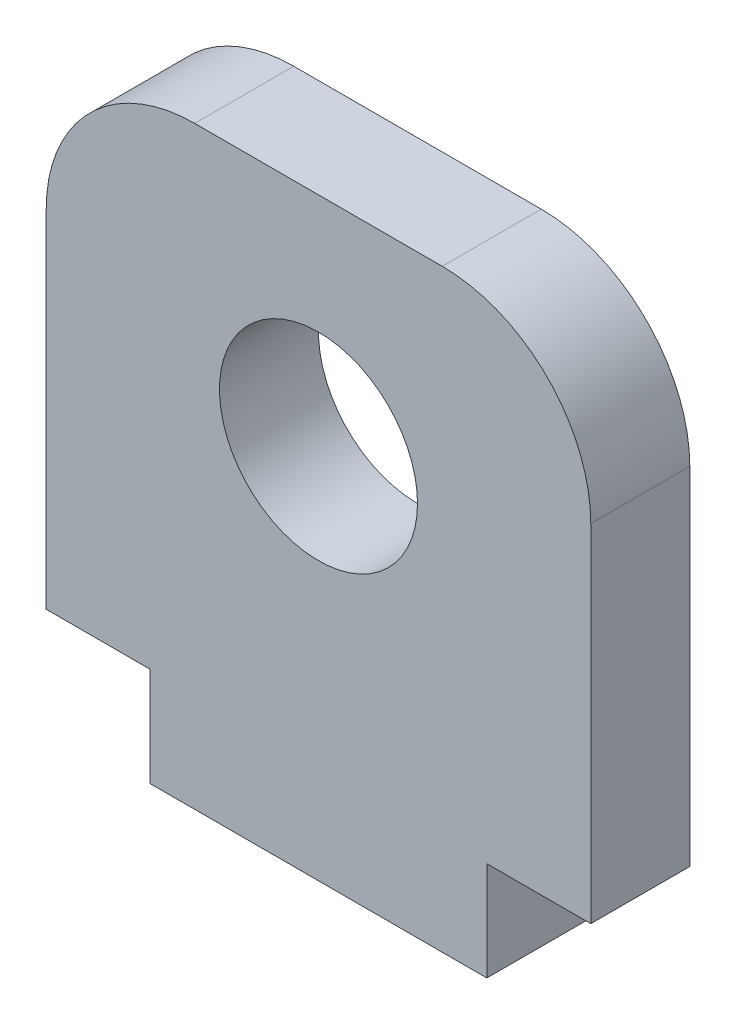
ISO-10303-21;
HEADER;
FILE_DESCRIPTION(('STEP AP214'),'2;1');
FILE_NAME('part.step','',(''),(''),'','','');
FILE_SCHEMA(('AUTOMOTIVE_DESIGN { 1 0 10303 214 1 1 1 1 }'));
ENDSEC;
DATA;
#1=APPLICATION_CONTEXT('core data for automotive mechanical design processes');
#2=APPLICATION_PROTOCOL_DEFINITION('international standard','automotive_design',2000,#1);
#3=PRODUCT_CONTEXT('',#1,'mechanical');
#4=PRODUCT('Part','Part','',(#3));
#5=PRODUCT_RELATED_PRODUCT_CATEGORY('part','',(#4));
#6=PRODUCT_DEFINITION_FORMATION('','',#4);
#7=PRODUCT_DEFINITION_CONTEXT('part definition',#1,'design');
#8=PRODUCT_DEFINITION('design','',#6,#7);
#9=PRODUCT_DEFINITION_SHAPE('','',#8);
#10=(LENGTH_UNIT() NAMED_UNIT(*) SI_UNIT(.MILLI.,.METRE.));
#11=(NAMED_UNIT(*) PLANE_ANGLE_UNIT() SI_UNIT($,.RADIAN.));
#12=(NAMED_UNIT(*) SI_UNIT($,.STERADIAN.) SOLID_ANGLE_UNIT());
#13=UNCERTAINTY_MEASURE_WITH_UNIT(LENGTH_MEASURE(1.E-05),#10,'distance_accuracy_value','');
#14=(GEOMETRIC_REPRESENTATION_CONTEXT(3) GLOBAL_UNCERTAINTY_ASSIGNED_CONTEXT((#13)) GLOBAL_UNIT_ASSIGNED_CONTEXT((#10,
#11,#12)) REPRESENTATION_CONTEXT('',''));
#15=CARTESIAN_POINT('',(0.,0.,0.));
#16=DIRECTION('',(0.,0.,1.));
#17=DIRECTION('',(1.,0.,0.));
#18=AXIS2_PLACEMENT_3D('',#15,#16,#17);
#19=CARTESIAN_POINT('',(-16.9999999999995,-2.88657986402541E-12,5.00000000000192));
#20=DIRECTION('',(-1.00000000000001,0.,0.));
#21=DIRECTION('',(0.,1.,0.));
#22=AXIS2_PLACEMENT_3D('',#19,#20,#21);
#23=PLANE('',#22);
#24=DIRECTION('',(0.,0.,1.00000000000001));
#25=VECTOR('',#24,1.);
#26=CARTESIAN_POINT('',(-16.9999999999997,10.0000000000049,5.00000000000039));
#27=LINE('',#26,#25);
#28=CARTESIAN_POINT('',(-16.9999999999994,10.0000000000007,-5.00000000000167));
#29=VERTEX_POINT('',#28);
#30=CARTESIAN_POINT('',(-16.9999999999997,10.0000000000049,5.00000000000039));
#31=VERTEX_POINT('',#30);
#32=EDGE_CURVE('E11',#29,#31,#27,.T.);
#33=ORIENTED_EDGE('',*,*,#32,.F.);
#34=DIRECTION('',(0.,1.,0.));
#35=VECTOR('',#34,1.);
#36=CARTESIAN_POINT('',(-16.9999999999994,60.0000000000006,-5.00000000000475));
#37=LINE('',#36,#35);
#38=CARTESIAN_POINT('',(-16.9999999999996,5.44009282066327E-12,-4.99999999999892));
#39=VERTEX_POINT('',#38);
#40=EDGE_CURVE('E115',#39,#29,#37,.T.);
#41=ORIENTED_EDGE('',*,*,#40,.F.);
#42=DIRECTION('',(0.,0.,1.00000000000001));
#43=VECTOR('',#42,1.);
#44=CARTESIAN_POINT('',(-16.9999999999995,-2.88657986402541E-12,5.00000000000192));
#45=LINE('',#44,#43);
#46=CARTESIAN_POINT('',(-16.9999999999995,-2.88657986402541E-12,5.00000000000192));
#47=VERTEX_POINT('',#46);
#48=EDGE_CURVE('E51',#39,#47,#45,.T.);
#49=ORIENTED_EDGE('',*,*,#48,.T.);
#50=DIRECTION('',(0.,1.,0.));
#51=VECTOR('',#50,1.);
#52=CARTESIAN_POINT('',(-16.9999999999995,-2.88657986402541E-12,5.00000000000192));
#53=LINE('',#52,#51);
#54=EDGE_CURVE('E190',#47,#31,#53,.T.);
#55=ORIENTED_EDGE('',*,*,#54,.T.);
#56=EDGE_LOOP('',(#33,#41,#49,#55));
#57=FACE_BOUND('',#56,.T.);
#58=ADVANCED_FACE('F40',(#57),#23,.T.);
#59=CARTESIAN_POINT('',(-27.4999999999993,-2.88657986402541E-12,4.99999999999942));
#60=DIRECTION('',(0.,1.,0.));
#61=DIRECTION('',(1.00000000000001,0.,0.));
#62=AXIS2_PLACEMENT_3D('',#59,#60,#61);
#63=PLANE('',#62);
#64=ORIENTED_EDGE('',*,*,#48,.F.);
#65=DIRECTION('',(-1.00000000000001,0.,0.));
#66=VECTOR('',#65,1.);
#67=CARTESIAN_POINT('',(-27.4999999999994,5.55111512312578E-12,-5.00000000000073));
#68=LINE('',#67,#66);
#69=CARTESIAN_POINT('',(17.0000000000031,5.44009282066327E-12,-5.00000000000289));
#70=VERTEX_POINT('',#69);
#71=EDGE_CURVE('E152',#39,#70,#68,.F.);
#72=ORIENTED_EDGE('',*,*,#71,.T.);
#73=DIRECTION('',(0.,0.,1.00000000000001));
#74=VECTOR('',#73,1.);
#75=CARTESIAN_POINT('',(17.0000000000005,-2.99760216648792E-12,5.00000000000061));
#76=LINE('',#75,#74);
#77=CARTESIAN_POINT('',(17.0000000000005,-2.99760216648792E-12,5.00000000000061));
#78=VERTEX_POINT('',#77);
#79=EDGE_CURVE('E179',#70,#78,#76,.T.);
#80=ORIENTED_EDGE('',*,*,#79,.T.);
#81=DIRECTION('',(1.00000000000001,0.,0.));
#82=VECTOR('',#81,1.);
#83=CARTESIAN_POINT('',(-27.4999999999993,-2.88657986402541E-12,4.99999999999942));
#84=LINE('',#83,#82);
#85=EDGE_CURVE('E199',#47,#78,#84,.T.);
#86=ORIENTED_EDGE('',*,*,#85,.F.);
#87=EDGE_LOOP('',(#64,#72,#80,#86));
#88=FACE_BOUND('',#87,.T.);
#89=ADVANCED_FACE('F202',(#88),#63,.F.);
#90=CARTESIAN_POINT('',(17.0000000000005,-2.99760216648792E-12,5.00000000000061));
#91=DIRECTION('',(1.00000000000001,0.,0.));
#92=DIRECTION('',(0.,-1.,0.));
#93=AXIS2_PLACEMENT_3D('',#90,#91,#92);
#94=PLANE('',#93);
#95=ORIENTED_EDGE('',*,*,#79,.F.);
#96=DIRECTION('',(0.,1.,0.));
#97=VECTOR('',#96,1.);
#98=CARTESIAN_POINT('',(17.0000000000029,60.0000000000006,-4.99999999999973));
#99=LINE('',#98,#97);
#100=CARTESIAN_POINT('',(17.0000000000028,10.0000000000006,-5.00000000000139));
#101=VERTEX_POINT('',#100);
#102=EDGE_CURVE('E148',#101,#70,#99,.F.);
#103=ORIENTED_EDGE('',*,*,#102,.F.);
#104=DIRECTION('',(0.,0.,1.00000000000001));
#105=VECTOR('',#104,1.);
#106=CARTESIAN_POINT('',(17.0000000000001,10.0000000000048,4.99999999999681));
#107=LINE('',#106,#105);
#108=CARTESIAN_POINT('',(17.0000000000001,10.0000000000048,4.99999999999681));
#109=VERTEX_POINT('',#108);
#110=EDGE_CURVE('E175',#101,#109,#107,.T.);
#111=ORIENTED_EDGE('',*,*,#110,.T.);
#112=DIRECTION('',(0.,-1.,0.));
#113=VECTOR('',#112,1.);
#114=CARTESIAN_POINT('',(17.0000000000005,-2.99760216648792E-12,5.00000000000061));
#115=LINE('',#114,#113);
#116=EDGE_CURVE('E204',#109,#78,#115,.T.);
#117=ORIENTED_EDGE('',*,*,#116,.T.);
#118=EDGE_LOOP('',(#95,#103,#111,#117));
#119=FACE_BOUND('',#118,.T.);
#120=ADVANCED_FACE('F259',(#119),#94,.T.);
#121=CARTESIAN_POINT('',(27.5000000000018,10.0000000000048,4.9999999999972));
#122=DIRECTION('',(0.,-1.,0.));
#123=DIRECTION('',(-1.00000000000001,0.,0.));
#124=AXIS2_PLACEMENT_3D('',#121,#122,#123);
#125=PLANE('',#124);
#126=ORIENTED_EDGE('',*,*,#110,.F.);
#127=DIRECTION('',(-1.00000000000001,0.,0.));
#128=VECTOR('',#127,1.);
#129=CARTESIAN_POINT('',(-27.4999999999992,10.0000000000007,-4.99999999999984));
#130=LINE('',#129,#128);
#131=CARTESIAN_POINT('',(27.5000000000029,10.0000000000006,-5.00000000000261));
#132=VERTEX_POINT('',#131);
#133=EDGE_CURVE('E144',#132,#101,#130,.T.);
#134=ORIENTED_EDGE('',*,*,#133,.F.);
#135=DIRECTION('',(0.,0.,1.00000000000001));
#136=VECTOR('',#135,1.);
#137=CARTESIAN_POINT('',(27.5000000000018,10.0000000000048,4.9999999999972));
#138=LINE('',#137,#136);
#139=CARTESIAN_POINT('',(27.5000000000018,10.0000000000048,4.9999999999972));
#140=VERTEX_POINT('',#139);
#141=EDGE_CURVE('E171',#132,#140,#138,.T.);
#142=ORIENTED_EDGE('',*,*,#141,.T.);
#143=DIRECTION('',(-1.00000000000001,0.,0.));
#144=VECTOR('',#143,1.);
#145=CARTESIAN_POINT('',(27.5000000000018,10.0000000000048,4.9999999999972));
#146=LINE('',#145,#144);
#147=EDGE_CURVE('E208',#140,#109,#146,.T.);
#148=ORIENTED_EDGE('',*,*,#147,.T.);
#149=EDGE_LOOP('',(#126,#134,#142,#148));
#150=FACE_BOUND('',#149,.T.);
#151=ADVANCED_FACE('F251',(#150),#125,.T.);
#152=CARTESIAN_POINT('',(27.5000000000018,60.0000000000045,4.99999999999973));
#153=DIRECTION('',(1.00000000000001,0.,0.));
#154=DIRECTION('',(0.,-1.,0.));
#155=AXIS2_PLACEMENT_3D('',#152,#153,#154);
#156=PLANE('',#155);
#157=ORIENTED_EDGE('',*,*,#141,.F.);
#158=DIRECTION('',(0.,1.,0.));
#159=VECTOR('',#158,1.);
#160=CARTESIAN_POINT('',(27.5000000000027,60.0000000000007,-4.99999999999962));
#161=LINE('',#160,#159);
#162=CARTESIAN_POINT('',(27.500000000002,45.0000000000007,-5.00000000000134));
#163=VERTEX_POINT('',#162);
#164=EDGE_CURVE('E140',#163,#132,#161,.F.);
#165=ORIENTED_EDGE('',*,*,#164,.F.);
#166=DIRECTION('',(0.,0.,1.00000000000001));
#167=VECTOR('',#166,1.);
#168=CARTESIAN_POINT('',(27.500000000001,45.000000000005,5.0000000000022));
#169=LINE('',#168,#167);
#170=CARTESIAN_POINT('',(27.500000000001,45.000000000005,5.0000000000022));
#171=VERTEX_POINT('',#170);
#172=EDGE_CURVE('E167',#163,#171,#169,.T.);
#173=ORIENTED_EDGE('',*,*,#172,.T.);
#174=DIRECTION('',(0.,-1.,0.));
#175=VECTOR('',#174,1.);
#176=CARTESIAN_POINT('',(27.5000000000018,60.0000000000045,4.99999999999973));
#177=LINE('',#176,#175);
#178=EDGE_CURVE('E215',#171,#140,#177,.T.);
#179=ORIENTED_EDGE('',*,*,#178,.T.);
#180=EDGE_LOOP('',(#157,#165,#173,#179));
#181=FACE_BOUND('',#180,.T.);
#182=ADVANCED_FACE('F244',(#181),#156,.T.);
#183=CARTESIAN_POINT('',(12.5000000000018,45.0000000000047,5.00000000000037));
#184=DIRECTION('',(0.,0.,-1.00000000000001));
#185=DIRECTION('',(-1.00000000000001,0.,0.));
#186=AXIS2_PLACEMENT_3D('',#183,#184,#185);
#187=CYLINDRICAL_SURFACE('',#186,15.);
#188=ORIENTED_EDGE('',*,*,#172,.F.);
#189=CARTESIAN_POINT('',(12.5000000000017,45.0000000000006,-5.00000000000389));
#190=DIRECTION('',(0.,0.,-1.00000000000001));
#191=DIRECTION('',(-1.00000000000001,0.,0.));
#192=AXIS2_PLACEMENT_3D('',#189,#190,#191);
#193=CIRCLE('',#192,15.);
#194=CARTESIAN_POINT('',(12.5000000000026,60.0000000000006,-5.0000000000007));
#195=VERTEX_POINT('',#194);
#196=EDGE_CURVE('E136',#163,#195,#193,.F.);
#197=ORIENTED_EDGE('',*,*,#196,.T.);
#198=DIRECTION('',(0.,0.,1.00000000000001));
#199=VECTOR('',#198,1.);
#200=CARTESIAN_POINT('',(12.5000000000023,60.0000000000047,4.99999999999987));
#201=LINE('',#200,#199);
#202=CARTESIAN_POINT('',(12.5000000000023,60.0000000000047,4.99999999999987));
#203=VERTEX_POINT('',#202);
#204=EDGE_CURVE('E163',#195,#203,#201,.T.);
#205=ORIENTED_EDGE('',*,*,#204,.T.);
#206=CARTESIAN_POINT('',(12.5000000000018,45.0000000000047,5.00000000000037));
#207=DIRECTION('',(0.,0.,-1.00000000000001));
#208=DIRECTION('',(-1.00000000000001,0.,0.));
#209=AXIS2_PLACEMENT_3D('',#206,#207,#208);
#210=CIRCLE('',#209,15.);
#211=EDGE_CURVE('E219',#171,#203,#210,.F.);
#212=ORIENTED_EDGE('',*,*,#211,.F.);
#213=EDGE_LOOP('',(#188,#197,#205,#212));
#214=FACE_BOUND('',#213,.T.);
#215=ADVANCED_FACE('F239',(#214),#187,.T.);
#216=CARTESIAN_POINT('',(-27.4999999999998,60.0000000000047,4.9999999999995));
#217=DIRECTION('',(0.,1.,0.));
#218=DIRECTION('',(1.00000000000001,0.,0.));
#219=AXIS2_PLACEMENT_3D('',#216,#217,#218);
#220=PLANE('',#219);
#221=ORIENTED_EDGE('',*,*,#204,.F.);
#222=DIRECTION('',(-1.00000000000001,0.,0.));
#223=VECTOR('',#222,1.);
#224=CARTESIAN_POINT('',(-27.4999999999996,60.0000000000006,-5.00000000000356));
#225=LINE('',#224,#223);
#226=CARTESIAN_POINT('',(-12.4999999999998,60.0000000000006,-4.99999999999887));
#227=VERTEX_POINT('',#226);
#228=EDGE_CURVE('E132',#227,#195,#225,.F.);
#229=ORIENTED_EDGE('',*,*,#228,.F.);
#230=DIRECTION('',(0.,0.,1.00000000000001));
#231=VECTOR('',#230,1.);
#232=CARTESIAN_POINT('',(-12.499999999999,60.0000000000049,4.99999999999953));
#233=LINE('',#232,#231);
#234=CARTESIAN_POINT('',(-12.499999999999,60.0000000000049,4.99999999999953));
#235=VERTEX_POINT('',#234);
#236=EDGE_CURVE('E160',#227,#235,#233,.T.);
#237=ORIENTED_EDGE('',*,*,#236,.T.);
#238=DIRECTION('',(1.00000000000001,0.,0.));
#239=VECTOR('',#238,1.);
#240=CARTESIAN_POINT('',(-27.4999999999998,60.0000000000047,4.9999999999995));
#241=LINE('',#240,#239);
#242=EDGE_CURVE('E223',#235,#203,#241,.T.);
#243=ORIENTED_EDGE('',*,*,#242,.T.);
#244=EDGE_LOOP('',(#221,#229,#237,#243));
#245=FACE_BOUND('',#244,.T.);
#246=ADVANCED_FACE('F235',(#245),#220,.T.);
#247=CARTESIAN_POINT('',(-12.4999999999968,45.0000000000047,5.00000000000106));
#248=DIRECTION('',(0.,0.,-1.00000000000001));
#249=DIRECTION('',(-1.00000000000001,0.,0.));
#250=AXIS2_PLACEMENT_3D('',#247,#248,#249);
#251=CYLINDRICAL_SURFACE('',#250,15.);
#252=ORIENTED_EDGE('',*,*,#236,.F.);
#253=CARTESIAN_POINT('',(-12.4999999999972,45.0000000000005,-5.00000000000095));
#254=DIRECTION('',(0.,0.,-1.00000000000001));
#255=DIRECTION('',(-1.00000000000001,0.,0.));
#256=AXIS2_PLACEMENT_3D('',#253,#254,#255);
#257=CIRCLE('',#256,15.);
#258=CARTESIAN_POINT('',(-27.4999999999976,45.0000000000007,-5.00000000000009));
#259=VERTEX_POINT('',#258);
#260=EDGE_CURVE('E128',#227,#259,#257,.F.);
#261=ORIENTED_EDGE('',*,*,#260,.T.);
#262=DIRECTION('',(0.,0.,1.00000000000001));
#263=VECTOR('',#262,1.);
#264=CARTESIAN_POINT('',(-27.4999999999977,45.000000000005,5.0000000000012));
#265=LINE('',#264,#263);
#266=CARTESIAN_POINT('',(-27.4999999999977,45.000000000005,5.0000000000012));
#267=VERTEX_POINT('',#266);
#268=EDGE_CURVE('E59',#259,#267,#265,.T.);
#269=ORIENTED_EDGE('',*,*,#268,.T.);
#270=CARTESIAN_POINT('',(-12.4999999999968,45.0000000000047,5.00000000000106));
#271=DIRECTION('',(0.,0.,-1.00000000000001));
#272=DIRECTION('',(-1.00000000000001,0.,0.));
#273=AXIS2_PLACEMENT_3D('',#270,#271,#272);
#274=CIRCLE('',#273,15.);
#275=EDGE_CURVE('E108',#235,#267,#274,.F.);
#276=ORIENTED_EDGE('',*,*,#275,.F.);
#277=EDGE_LOOP('',(#252,#261,#269,#276));
#278=FACE_BOUND('',#277,.T.);
#279=ADVANCED_FACE('F232',(#278),#251,.T.);
#280=CARTESIAN_POINT('',(-27.4999999999998,60.0000000000047,4.9999999999995));
#281=DIRECTION('',(1.00000000000001,0.,0.));
#282=DIRECTION('',(0.,-1.,0.));
#283=AXIS2_PLACEMENT_3D('',#280,#281,#282);
#284=PLANE('',#283);
#285=ORIENTED_EDGE('',*,*,#268,.F.);
#286=DIRECTION('',(0.,1.,0.));
#287=VECTOR('',#286,1.);
#288=CARTESIAN_POINT('',(-27.4999999999996,60.0000000000006,-5.00000000000356));
#289=LINE('',#288,#287);
#290=CARTESIAN_POINT('',(-27.4999999999992,10.0000000000007,-4.99999999999984));
#291=VERTEX_POINT('',#290);
#292=EDGE_CURVE('E113',#259,#291,#289,.F.);
#293=ORIENTED_EDGE('',*,*,#292,.T.);
#294=DIRECTION('',(0.,0.,1.00000000000001));
#295=VECTOR('',#294,1.);
#296=CARTESIAN_POINT('',(-27.4999999999993,10.0000000000048,5.00000000000025));
#297=LINE('',#296,#295);
#298=CARTESIAN_POINT('',(-27.4999999999993,10.0000000000048,5.00000000000025));
#299=VERTEX_POINT('',#298);
#300=EDGE_CURVE('E44',#291,#299,#297,.T.);
#301=ORIENTED_EDGE('',*,*,#300,.T.);
#302=DIRECTION('',(0.,-1.,0.));
#303=VECTOR('',#302,1.);
#304=CARTESIAN_POINT('',(-27.4999999999998,60.0000000000047,4.9999999999995));
#305=LINE('',#304,#303);
#306=EDGE_CURVE('E231',#267,#299,#305,.T.);
#307=ORIENTED_EDGE('',*,*,#306,.F.);
#308=EDGE_LOOP('',(#285,#293,#301,#307));
#309=FACE_BOUND('',#308,.T.);
#310=ADVANCED_FACE('F118',(#309),#284,.F.);
#311=CARTESIAN_POINT('',(0.,38.0000000000047,5.00000000000012));
#312=DIRECTION('',(0.,0.,-1.00000000000001));
#313=DIRECTION('',(-1.00000000000001,0.,0.));
#314=AXIS2_PLACEMENT_3D('',#311,#312,#313);
#315=CYLINDRICAL_SURFACE('',#314,10.);
#316=CARTESIAN_POINT('',(0.,38.0000000000047,5.00000000000012));
#317=DIRECTION('',(0.,0.,1.00000000000001));
#318=DIRECTION('',(1.00000000000001,0.,0.));
#319=AXIS2_PLACEMENT_3D('',#316,#317,#318);
#320=CIRCLE('',#319,10.);
#321=CARTESIAN_POINT('',(10.0000000000001,38.0000000000047,5.00000000000011));
#322=VERTEX_POINT('',#321);
#323=EDGE_CURVE('E131',#322,#322,#320,.T.);
#324=ORIENTED_EDGE('',*,*,#323,.T.);
#325=EDGE_LOOP('',(#324));
#326=FACE_BOUND('',#325,.T.);
#327=CARTESIAN_POINT('',(1.08246744900953E-12,38.0000000000006,-5.000000000001));
#328=DIRECTION('',(0.,0.,1.00000000000001));
#329=DIRECTION('',(1.00000000000001,0.,0.));
#330=AXIS2_PLACEMENT_3D('',#327,#328,#329);
#331=CIRCLE('',#330,10.);
#332=CARTESIAN_POINT('',(10.0000000000011,38.0000000000006,-5.000000000001));
#333=VERTEX_POINT('',#332);
#334=EDGE_CURVE('E120',#333,#333,#331,.T.);
#335=ORIENTED_EDGE('',*,*,#334,.F.);
#336=EDGE_LOOP('',(#335));
#337=FACE_BOUND('',#336,.T.);
#338=ADVANCED_FACE('F334',(#326,#337),#315,.F.);
#339=CARTESIAN_POINT('',(-27.4999999999993,10.0000000000048,5.00000000000025));
#340=DIRECTION('',(0.,-1.,0.));
#341=DIRECTION('',(-1.00000000000001,0.,0.));
#342=AXIS2_PLACEMENT_3D('',#339,#340,#341);
#343=PLANE('',#342);
#344=DIRECTION('',(-1.00000000000001,0.,0.));
#345=VECTOR('',#344,1.);
#346=CARTESIAN_POINT('',(-27.4999999999992,10.0000000000007,-4.99999999999984));
#347=LINE('',#346,#345);
#348=EDGE_CURVE('E101',#29,#291,#347,.T.);
#349=ORIENTED_EDGE('',*,*,#348,.F.);
#350=ORIENTED_EDGE('',*,*,#32,.T.);
#351=DIRECTION('',(-1.00000000000001,0.,0.));
#352=VECTOR('',#351,1.);
#353=CARTESIAN_POINT('',(-27.4999999999993,10.0000000000048,5.00000000000025));
#354=LINE('',#353,#352);
#355=EDGE_CURVE('E103',#31,#299,#354,.T.);
#356=ORIENTED_EDGE('',*,*,#355,.T.);
#357=ORIENTED_EDGE('',*,*,#300,.F.);
#358=EDGE_LOOP('',(#349,#350,#356,#357));
#359=FACE_BOUND('',#358,.T.);
#360=ADVANCED_FACE('F42',(#359),#343,.T.);
#361=CARTESIAN_POINT('',(-27.4999999999998,60.0000000000047,4.9999999999995));
#362=DIRECTION('',(0.,0.,-1.00000000000001));
#363=DIRECTION('',(-1.00000000000001,0.,0.));
#364=AXIS2_PLACEMENT_3D('',#361,#362,#363);
#365=PLANE('',#364);
#366=ORIENTED_EDGE('',*,*,#323,.F.);
#367=EDGE_LOOP('',(#366));
#368=FACE_BOUND('',#367,.T.);
#369=ORIENTED_EDGE('',*,*,#306,.T.);
#370=ORIENTED_EDGE('',*,*,#355,.F.);
#371=ORIENTED_EDGE('',*,*,#54,.F.);
#372=ORIENTED_EDGE('',*,*,#85,.T.);
#373=ORIENTED_EDGE('',*,*,#116,.F.);
#374=ORIENTED_EDGE('',*,*,#147,.F.);
#375=ORIENTED_EDGE('',*,*,#178,.F.);
#376=ORIENTED_EDGE('',*,*,#211,.T.);
#377=ORIENTED_EDGE('',*,*,#242,.F.);
#378=ORIENTED_EDGE('',*,*,#275,.T.);
#379=EDGE_LOOP('',(#369,#370,#371,#372,#373,#374,#375,#376,#377,#378));
#380=FACE_BOUND('',#379,.T.);
#381=ADVANCED_FACE('F197',(#368,#380),#365,.F.);
#382=CARTESIAN_POINT('',(-27.4999999999996,60.0000000000006,-5.00000000000356));
#383=DIRECTION('',(0.,0.,-1.00000000000001));
#384=DIRECTION('',(-1.00000000000001,0.,0.));
#385=AXIS2_PLACEMENT_3D('',#382,#383,#384);
#386=PLANE('',#385);
#387=ORIENTED_EDGE('',*,*,#334,.T.);
#388=EDGE_LOOP('',(#387));
#389=FACE_BOUND('',#388,.T.);
#390=ORIENTED_EDGE('',*,*,#292,.F.);
#391=ORIENTED_EDGE('',*,*,#260,.F.);
#392=ORIENTED_EDGE('',*,*,#228,.T.);
#393=ORIENTED_EDGE('',*,*,#196,.F.);
#394=ORIENTED_EDGE('',*,*,#164,.T.);
#395=ORIENTED_EDGE('',*,*,#133,.T.);
#396=ORIENTED_EDGE('',*,*,#102,.T.);
#397=ORIENTED_EDGE('',*,*,#71,.F.);
#398=ORIENTED_EDGE('',*,*,#40,.T.);
#399=ORIENTED_EDGE('',*,*,#348,.T.);
#400=EDGE_LOOP('',(#390,#391,#392,#393,#394,#395,#396,#397,#398,#399));
#401=FACE_BOUND('',#400,.T.);
#402=ADVANCED_FACE('F111',(#389,#401),#386,.T.);
#403=CLOSED_SHELL('',(#58,#89,#120,#151,#182,#215,#246,#279,#310,#338,#360,#381,#402));
#404=MANIFOLD_SOLID_BREP('B2',#403);
#405=ADVANCED_BREP_SHAPE_REPRESENTATION('',(#18,#404),#14);
#406=SHAPE_DEFINITION_REPRESENTATION(#9,#405);
ENDSEC;
END-ISO-10303-21;
